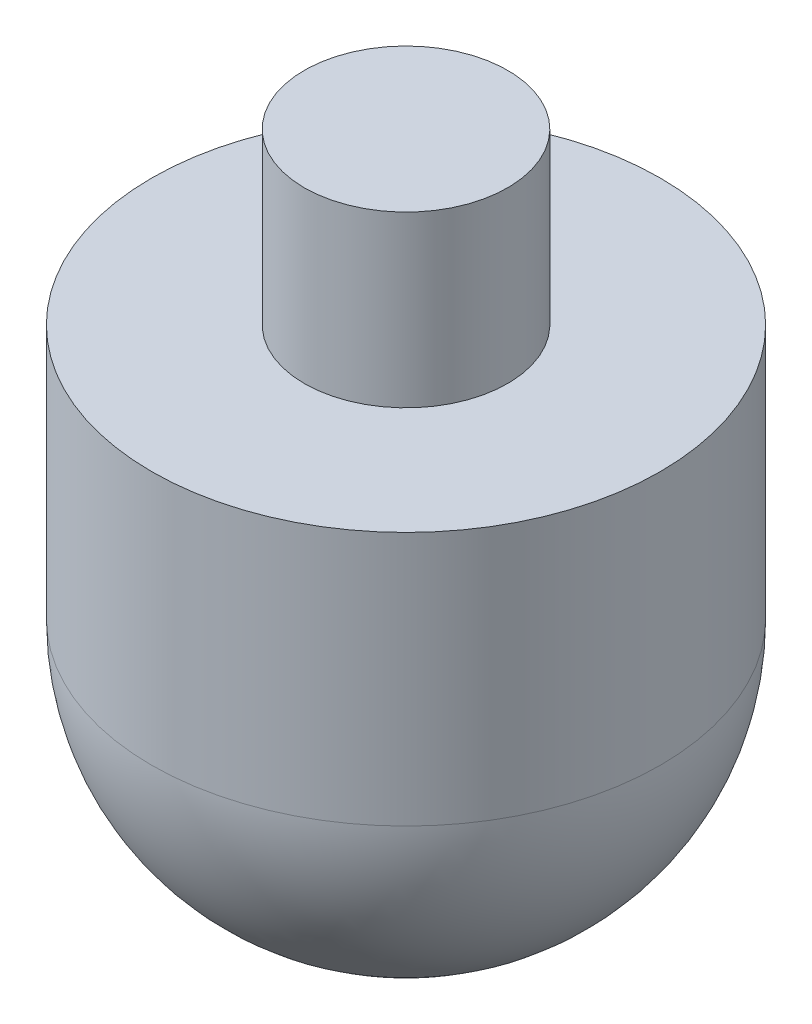
ISO-10303-21;
HEADER;
FILE_DESCRIPTION(('STEP AP214'),'2;1');
FILE_NAME('part.step','',(''),(''),'','','');
FILE_SCHEMA(('AUTOMOTIVE_DESIGN { 1 0 10303 214 1 1 1 1 }'));
ENDSEC;
DATA;
#1=APPLICATION_CONTEXT('core data for automotive mechanical design processes');
#2=APPLICATION_PROTOCOL_DEFINITION('international standard','automotive_design',2000,#1);
#3=PRODUCT_CONTEXT('',#1,'mechanical');
#4=PRODUCT('Part','Part','',(#3));
#5=PRODUCT_RELATED_PRODUCT_CATEGORY('part','',(#4));
#6=PRODUCT_DEFINITION_FORMATION('','',#4);
#7=PRODUCT_DEFINITION_CONTEXT('part definition',#1,'design');
#8=PRODUCT_DEFINITION('design','',#6,#7);
#9=PRODUCT_DEFINITION_SHAPE('','',#8);
#10=(LENGTH_UNIT() NAMED_UNIT(*) SI_UNIT(.MILLI.,.METRE.));
#11=(NAMED_UNIT(*) PLANE_ANGLE_UNIT() SI_UNIT($,.RADIAN.));
#12=(NAMED_UNIT(*) SI_UNIT($,.STERADIAN.) SOLID_ANGLE_UNIT());
#13=UNCERTAINTY_MEASURE_WITH_UNIT(LENGTH_MEASURE(1.E-05),#10,'distance_accuracy_value','');
#14=(GEOMETRIC_REPRESENTATION_CONTEXT(3) GLOBAL_UNCERTAINTY_ASSIGNED_CONTEXT((#13)) GLOBAL_UNIT_ASSIGNED_CONTEXT((#10,
#11,#12)) REPRESENTATION_CONTEXT('',''));
#15=CARTESIAN_POINT('',(0.,0.,0.));
#16=DIRECTION('',(0.,0.,1.));
#17=DIRECTION('',(1.,0.,0.));
#18=AXIS2_PLACEMENT_3D('',#15,#16,#17);
#19=CARTESIAN_POINT('',(0.,-25.,0.));
#20=DIRECTION('',(0.,1.,0.));
#21=DIRECTION('',(-1.,0.,0.));
#22=AXIS2_PLACEMENT_3D('',#19,#20,#21);
#23=SPHERICAL_SURFACE('',#22,15.);
#24=CARTESIAN_POINT('',(0.,-25.,0.));
#25=DIRECTION('',(0.,1.,0.));
#26=DIRECTION('',(0.,0.,1.));
#27=AXIS2_PLACEMENT_3D('',#24,#25,#26);
#28=CIRCLE('',#27,15.);
#29=CARTESIAN_POINT('',(0.,-25.,15.));
#30=VERTEX_POINT('',#29);
#31=EDGE_CURVE('E10',#30,#30,#28,.T.);
#32=ORIENTED_EDGE('',*,*,#31,.F.);
#33=EDGE_LOOP('',(#32));
#34=FACE_BOUND('',#33,.T.);
#35=ADVANCED_FACE('F31',(#34),#23,.T.);
#36=CARTESIAN_POINT('',(0.,88.3227272727273,0.));
#37=DIRECTION('',(0.,1.,0.));
#38=DIRECTION('',(0.,0.,1.));
#39=AXIS2_PLACEMENT_3D('',#36,#37,#38);
#40=CYLINDRICAL_SURFACE('',#39,15.);
#41=CARTESIAN_POINT('',(0.,-9.99999999999999,0.));
#42=DIRECTION('',(0.,1.,0.));
#43=DIRECTION('',(0.,0.,1.));
#44=AXIS2_PLACEMENT_3D('',#41,#42,#43);
#45=CIRCLE('',#44,15.);
#46=CARTESIAN_POINT('',(0.,-9.99999999999999,15.));
#47=VERTEX_POINT('',#46);
#48=EDGE_CURVE('E37',#47,#47,#45,.T.);
#49=ORIENTED_EDGE('',*,*,#48,.F.);
#50=EDGE_LOOP('',(#49));
#51=FACE_BOUND('',#50,.T.);
#52=ORIENTED_EDGE('',*,*,#31,.T.);
#53=EDGE_LOOP('',(#52));
#54=FACE_BOUND('',#53,.T.);
#55=ADVANCED_FACE('F61',(#51,#54),#40,.T.);
#56=CARTESIAN_POINT('',(15.,-10.,0.));
#57=DIRECTION('',(0.,-1.,0.));
#58=DIRECTION('',(0.,0.,-1.));
#59=AXIS2_PLACEMENT_3D('',#56,#57,#58);
#60=PLANE('',#59);
#61=CARTESIAN_POINT('',(0.,-10.,0.));
#62=DIRECTION('',(0.,1.,0.));
#63=DIRECTION('',(0.,0.,1.));
#64=AXIS2_PLACEMENT_3D('',#61,#62,#63);
#65=CIRCLE('',#64,6.00000000000002);
#66=CARTESIAN_POINT('',(0.,-10.,6.00000000000002));
#67=VERTEX_POINT('',#66);
#68=EDGE_CURVE('E41',#67,#67,#65,.T.);
#69=ORIENTED_EDGE('',*,*,#68,.F.);
#70=EDGE_LOOP('',(#69));
#71=FACE_BOUND('',#70,.T.);
#72=ORIENTED_EDGE('',*,*,#48,.T.);
#73=EDGE_LOOP('',(#72));
#74=FACE_BOUND('',#73,.T.);
#75=ADVANCED_FACE('F56',(#71,#74),#60,.F.);
#76=CARTESIAN_POINT('',(0.,88.3227272727273,0.));
#77=DIRECTION('',(0.,1.,0.));
#78=DIRECTION('',(0.,0.,1.));
#79=AXIS2_PLACEMENT_3D('',#76,#77,#78);
#80=CYLINDRICAL_SURFACE('',#79,6.00000000000002);
#81=CARTESIAN_POINT('',(0.,0.,0.));
#82=DIRECTION('',(0.,1.,0.));
#83=DIRECTION('',(0.,0.,1.));
#84=AXIS2_PLACEMENT_3D('',#81,#82,#83);
#85=CIRCLE('',#84,6.00000000000002);
#86=CARTESIAN_POINT('',(0.,0.,6.00000000000002));
#87=VERTEX_POINT('',#86);
#88=EDGE_CURVE('E45',#87,#87,#85,.T.);
#89=ORIENTED_EDGE('',*,*,#88,.F.);
#90=EDGE_LOOP('',(#89));
#91=FACE_BOUND('',#90,.T.);
#92=ORIENTED_EDGE('',*,*,#68,.T.);
#93=EDGE_LOOP('',(#92));
#94=FACE_BOUND('',#93,.T.);
#95=ADVANCED_FACE('F53',(#91,#94),#80,.T.);
#96=CARTESIAN_POINT('',(6.00000000000002,0.,0.));
#97=DIRECTION('',(0.,-1.,0.));
#98=DIRECTION('',(0.,0.,-1.));
#99=AXIS2_PLACEMENT_3D('',#96,#97,#98);
#100=PLANE('',#99);
#101=ORIENTED_EDGE('',*,*,#88,.T.);
#102=EDGE_LOOP('',(#101));
#103=FACE_BOUND('',#102,.T.);
#104=ADVANCED_FACE('F51',(#103),#100,.F.);
#105=CLOSED_SHELL('',(#35,#55,#75,#95,#104));
#106=MANIFOLD_SOLID_BREP('B2',#105);
#107=ADVANCED_BREP_SHAPE_REPRESENTATION('',(#18,#106),#14);
#108=SHAPE_DEFINITION_REPRESENTATION(#9,#107);
ENDSEC;
END-ISO-10303-21;
